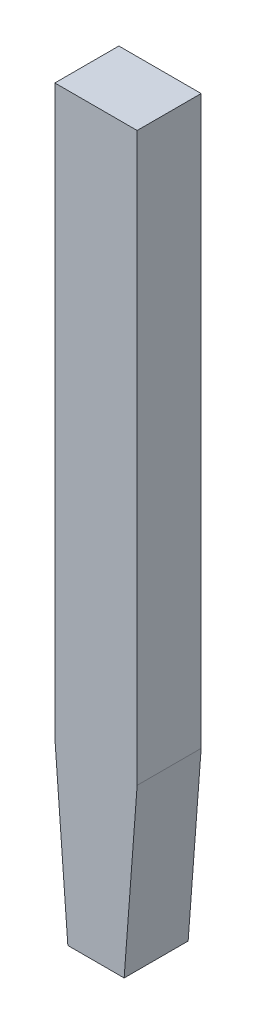
ISO-10303-21;
HEADER;
FILE_DESCRIPTION(('STEP AP214'),'2;1');
FILE_NAME('part.step','',(''),(''),'','','');
FILE_SCHEMA(('AUTOMOTIVE_DESIGN { 1 0 10303 214 1 1 1 1 }'));
ENDSEC;
DATA;
#1=APPLICATION_CONTEXT('core data for automotive mechanical design processes');
#2=APPLICATION_PROTOCOL_DEFINITION('international standard','automotive_design',2000,#1);
#3=PRODUCT_CONTEXT('',#1,'mechanical');
#4=PRODUCT('Part','Part','',(#3));
#5=PRODUCT_RELATED_PRODUCT_CATEGORY('part','',(#4));
#6=PRODUCT_DEFINITION_FORMATION('','',#4);
#7=PRODUCT_DEFINITION_CONTEXT('part definition',#1,'design');
#8=PRODUCT_DEFINITION('design','',#6,#7);
#9=PRODUCT_DEFINITION_SHAPE('','',#8);
#10=(LENGTH_UNIT() NAMED_UNIT(*) SI_UNIT(.MILLI.,.METRE.));
#11=(NAMED_UNIT(*) PLANE_ANGLE_UNIT() SI_UNIT($,.RADIAN.));
#12=(NAMED_UNIT(*) SI_UNIT($,.STERADIAN.) SOLID_ANGLE_UNIT());
#13=UNCERTAINTY_MEASURE_WITH_UNIT(LENGTH_MEASURE(1.E-05),#10,'distance_accuracy_value','');
#14=(GEOMETRIC_REPRESENTATION_CONTEXT(3) GLOBAL_UNCERTAINTY_ASSIGNED_CONTEXT((#13)) GLOBAL_UNIT_ASSIGNED_CONTEXT((#10,
#11,#12)) REPRESENTATION_CONTEXT('',''));
#15=CARTESIAN_POINT('',(0.,0.,0.));
#16=DIRECTION('',(0.,0.,1.));
#17=DIRECTION('',(1.,0.,0.));
#18=AXIS2_PLACEMENT_3D('',#15,#16,#17);
#19=CARTESIAN_POINT('',(50.41457889831,1.696835055312,3.705000000046));
#20=DIRECTION('',(0.,0.,1.));
#21=DIRECTION('',(1.,0.,0.));
#22=AXIS2_PLACEMENT_3D('',#19,#20,#21);
#23=PLANE('',#22);
#24=DIRECTION('',(1.,0.,0.));
#25=VECTOR('',#24,1.);
#26=CARTESIAN_POINT('',(38.93957889831,-15.17126218978,3.705000000046));
#27=LINE('',#26,#25);
#28=CARTESIAN_POINT('',(51.9806861916904,-15.17126218978,3.705000000046));
#29=VERTEX_POINT('',#28);
#30=CARTESIAN_POINT('',(52.2884716049296,-15.17126218978,3.705000000046));
#31=VERTEX_POINT('',#30);
#32=EDGE_CURVE('E94',#29,#31,#27,.T.);
#33=ORIENTED_EDGE('',*,*,#32,.T.);
#34=DIRECTION('',(0.0747899482416168,0.997199309888458,0.));
#35=VECTOR('',#34,1.);
#36=CARTESIAN_POINT('',(52.35957889831,-14.22316494469,3.705000000046));
#37=LINE('',#36,#35);
#38=CARTESIAN_POINT('',(52.35957889831,-14.2231649446899,3.705000000046));
#39=VERTEX_POINT('',#38);
#40=EDGE_CURVE('E98',#39,#31,#37,.F.);
#41=ORIENTED_EDGE('',*,*,#40,.F.);
#42=DIRECTION('',(0.,1.,0.));
#43=VECTOR('',#42,1.);
#44=CARTESIAN_POINT('',(52.35957889831,-10.46816494469,3.705000000046));
#45=LINE('',#44,#43);
#46=CARTESIAN_POINT('',(52.35957889831,-11.12202888849,3.705000000046));
#47=VERTEX_POINT('',#46);
#48=EDGE_CURVE('E83',#47,#39,#45,.F.);
#49=ORIENTED_EDGE('',*,*,#48,.F.);
#50=DIRECTION('',(1.,0.,0.));
#51=VECTOR('',#50,1.);
#52=CARTESIAN_POINT('',(44.47457889831,-11.12202888849,3.705000000046));
#53=LINE('',#52,#51);
#54=CARTESIAN_POINT('',(51.90957889831,-11.12202888849,3.705000000046));
#55=VERTEX_POINT('',#54);
#56=EDGE_CURVE('E20',#47,#55,#53,.F.);
#57=ORIENTED_EDGE('',*,*,#56,.T.);
#58=DIRECTION('',(0.,1.,0.));
#59=VECTOR('',#58,1.);
#60=CARTESIAN_POINT('',(51.90957889831,-10.46816494469,3.705000000046));
#61=LINE('',#60,#59);
#62=CARTESIAN_POINT('',(51.90957889831,-14.2231649446902,3.705000000046));
#63=VERTEX_POINT('',#62);
#64=EDGE_CURVE('E71',#63,#55,#61,.T.);
#65=ORIENTED_EDGE('',*,*,#64,.F.);
#66=DIRECTION('',(0.0747899482416168,-0.997199309888458,0.));
#67=VECTOR('',#66,1.);
#68=CARTESIAN_POINT('',(51.90957889831,-14.22316494469,3.705000000046));
#69=LINE('',#68,#67);
#70=EDGE_CURVE('E66',#29,#63,#69,.F.);
#71=ORIENTED_EDGE('',*,*,#70,.F.);
#72=EDGE_LOOP('',(#33,#41,#49,#57,#65,#71));
#73=FACE_BOUND('',#72,.T.);
#74=ADVANCED_FACE('F17',(#73),#23,.T.);
#75=CARTESIAN_POINT('',(44.47457889831,-11.12202888849,-0.158278306686));
#76=DIRECTION('',(0.,-1.,0.));
#77=DIRECTION('',(0.,0.,-1.));
#78=AXIS2_PLACEMENT_3D('',#75,#76,#77);
#79=PLANE('',#78);
#80=DIRECTION('',(1.,0.,0.));
#81=VECTOR('',#80,1.);
#82=CARTESIAN_POINT('',(50.41457889831,-11.12202888849,3.355000000046));
#83=LINE('',#82,#81);
#84=CARTESIAN_POINT('',(52.35957889831,-11.12202888849,3.355000000046));
#85=VERTEX_POINT('',#84);
#86=CARTESIAN_POINT('',(51.90957889831,-11.12202888849,3.355000000046));
#87=VERTEX_POINT('',#86);
#88=EDGE_CURVE('E89',#85,#87,#83,.F.);
#89=ORIENTED_EDGE('',*,*,#88,.T.);
#90=DIRECTION('',(0.,0.,1.));
#91=VECTOR('',#90,1.);
#92=CARTESIAN_POINT('',(51.90957889831,-11.12202888849,3.355000000046));
#93=LINE('',#92,#91);
#94=EDGE_CURVE('E76',#55,#87,#93,.F.);
#95=ORIENTED_EDGE('',*,*,#94,.F.);
#96=ORIENTED_EDGE('',*,*,#56,.F.);
#97=DIRECTION('',(0.,0.,-1.));
#98=VECTOR('',#97,1.);
#99=CARTESIAN_POINT('',(52.35957889831,-11.12202888849,3.355000000046));
#100=LINE('',#99,#98);
#101=EDGE_CURVE('E102',#85,#47,#100,.F.);
#102=ORIENTED_EDGE('',*,*,#101,.F.);
#103=EDGE_LOOP('',(#89,#95,#96,#102));
#104=FACE_BOUND('',#103,.T.);
#105=ADVANCED_FACE('F88',(#104),#79,.F.);
#106=CARTESIAN_POINT('',(51.90957889831,-10.46816494469,3.355000000046));
#107=DIRECTION('',(-1.,0.,0.));
#108=DIRECTION('',(0.,0.,1.));
#109=AXIS2_PLACEMENT_3D('',#106,#107,#108);
#110=PLANE('',#109);
#111=DIRECTION('',(0.,1.,0.));
#112=VECTOR('',#111,1.);
#113=CARTESIAN_POINT('',(51.90957889831,1.696835055312,3.355000000046));
#114=LINE('',#113,#112);
#115=CARTESIAN_POINT('',(51.90957889831,-14.2231649446901,3.355000000046));
#116=VERTEX_POINT('',#115);
#117=EDGE_CURVE('E107',#87,#116,#114,.F.);
#118=ORIENTED_EDGE('',*,*,#117,.T.);
#119=DIRECTION('',(0.,0.,1.));
#120=VECTOR('',#119,1.);
#121=CARTESIAN_POINT('',(51.90957889831,-14.22316494469,3.355000000046));
#122=LINE('',#121,#120);
#123=EDGE_CURVE('E78',#63,#116,#122,.F.);
#124=ORIENTED_EDGE('',*,*,#123,.F.);
#125=ORIENTED_EDGE('',*,*,#64,.T.);
#126=ORIENTED_EDGE('',*,*,#94,.T.);
#127=EDGE_LOOP('',(#118,#124,#125,#126));
#128=FACE_BOUND('',#127,.T.);
#129=ADVANCED_FACE('F74',(#128),#110,.T.);
#130=CARTESIAN_POINT('',(51.90957889831,-14.22316494469,3.355000000046));
#131=DIRECTION('',(-0.997199309888458,-0.0747899482416168,0.));
#132=DIRECTION('',(0.0747899482416168,-0.997199309888458,0.));
#133=AXIS2_PLACEMENT_3D('',#130,#131,#132);
#134=PLANE('',#133);
#135=ORIENTED_EDGE('',*,*,#70,.T.);
#136=ORIENTED_EDGE('',*,*,#123,.T.);
#137=DIRECTION('',(0.0747899482397982,-0.997199309888594,0.));
#138=VECTOR('',#137,1.);
#139=CARTESIAN_POINT('',(51.90957889831,-14.22316494469,3.355000000046));
#140=LINE('',#139,#138);
#141=CARTESIAN_POINT('',(51.9806861916909,-15.1712621897799,3.355000000046));
#142=VERTEX_POINT('',#141);
#143=EDGE_CURVE('E109',#116,#142,#140,.T.);
#144=ORIENTED_EDGE('',*,*,#143,.T.);
#145=DIRECTION('',(0.,0.,1.));
#146=VECTOR('',#145,1.);
#147=CARTESIAN_POINT('',(51.98068619169,-15.17126218978,-0.8137967800219));
#148=LINE('',#147,#146);
#149=EDGE_CURVE('E96',#142,#29,#148,.T.);
#150=ORIENTED_EDGE('',*,*,#149,.T.);
#151=EDGE_LOOP('',(#135,#136,#144,#150));
#152=FACE_BOUND('',#151,.T.);
#153=ADVANCED_FACE('F126',(#152),#134,.T.);
#154=CARTESIAN_POINT('',(38.93957889831,-15.17126218978,-0.8137967800219));
#155=DIRECTION('',(0.,1.,0.));
#156=DIRECTION('',(0.,0.,1.));
#157=AXIS2_PLACEMENT_3D('',#154,#155,#156);
#158=PLANE('',#157);
#159=DIRECTION('',(1.,0.,0.));
#160=VECTOR('',#159,1.);
#161=CARTESIAN_POINT('',(50.41457889831,-15.17126218978,3.355000000046));
#162=LINE('',#161,#160);
#163=CARTESIAN_POINT('',(52.2884716049296,-15.17126218978,3.355000000046));
#164=VERTEX_POINT('',#163);
#165=EDGE_CURVE('E112',#142,#164,#162,.T.);
#166=ORIENTED_EDGE('',*,*,#165,.T.);
#167=DIRECTION('',(0.,0.,1.));
#168=VECTOR('',#167,1.);
#169=CARTESIAN_POINT('',(52.2884716049283,-15.1712621897799,3.355000000046));
#170=LINE('',#169,#168);
#171=EDGE_CURVE('E100',#31,#164,#170,.F.);
#172=ORIENTED_EDGE('',*,*,#171,.F.);
#173=ORIENTED_EDGE('',*,*,#32,.F.);
#174=ORIENTED_EDGE('',*,*,#149,.F.);
#175=EDGE_LOOP('',(#166,#172,#173,#174));
#176=FACE_BOUND('',#175,.T.);
#177=ADVANCED_FACE('F125',(#176),#158,.F.);
#178=CARTESIAN_POINT('',(52.35957889831,-14.22316494469,3.355000000046));
#179=DIRECTION('',(0.997199309888458,-0.0747899482416168,0.));
#180=DIRECTION('',(0.0747899482416168,0.997199309888458,0.));
#181=AXIS2_PLACEMENT_3D('',#178,#179,#180);
#182=PLANE('',#181);
#183=DIRECTION('',(0.0747899482397982,0.997199309888594,0.));
#184=VECTOR('',#183,1.);
#185=CARTESIAN_POINT('',(52.28847160493,-15.17126218978,3.355000000046));
#186=LINE('',#185,#184);
#187=CARTESIAN_POINT('',(52.35957889831,-14.22316494469,3.355000000046));
#188=VERTEX_POINT('',#187);
#189=EDGE_CURVE('E26',#164,#188,#186,.T.);
#190=ORIENTED_EDGE('',*,*,#189,.T.);
#191=DIRECTION('',(0.,0.,-1.));
#192=VECTOR('',#191,1.);
#193=CARTESIAN_POINT('',(52.35957889831,-14.22316494469,3.355000000046));
#194=LINE('',#193,#192);
#195=EDGE_CURVE('E34',#39,#188,#194,.T.);
#196=ORIENTED_EDGE('',*,*,#195,.F.);
#197=ORIENTED_EDGE('',*,*,#40,.T.);
#198=ORIENTED_EDGE('',*,*,#171,.T.);
#199=EDGE_LOOP('',(#190,#196,#197,#198));
#200=FACE_BOUND('',#199,.T.);
#201=ADVANCED_FACE('F118',(#200),#182,.T.);
#202=CARTESIAN_POINT('',(52.35957889831,-10.46816494469,3.355000000046));
#203=DIRECTION('',(1.,0.,0.));
#204=DIRECTION('',(0.,0.,-1.));
#205=AXIS2_PLACEMENT_3D('',#202,#203,#204);
#206=PLANE('',#205);
#207=ORIENTED_EDGE('',*,*,#48,.T.);
#208=ORIENTED_EDGE('',*,*,#195,.T.);
#209=DIRECTION('',(0.,1.,0.));
#210=VECTOR('',#209,1.);
#211=CARTESIAN_POINT('',(52.35957889831,1.696835055312,3.355000000046));
#212=LINE('',#211,#210);
#213=EDGE_CURVE('E11',#188,#85,#212,.T.);
#214=ORIENTED_EDGE('',*,*,#213,.T.);
#215=ORIENTED_EDGE('',*,*,#101,.T.);
#216=EDGE_LOOP('',(#207,#208,#214,#215));
#217=FACE_BOUND('',#216,.T.);
#218=ADVANCED_FACE('F127',(#217),#206,.T.);
#219=CARTESIAN_POINT('',(50.41457889831,1.696835055312,3.355000000046));
#220=DIRECTION('',(0.,0.,1.));
#221=DIRECTION('',(1.,0.,0.));
#222=AXIS2_PLACEMENT_3D('',#219,#220,#221);
#223=PLANE('',#222);
#224=ORIENTED_EDGE('',*,*,#189,.F.);
#225=ORIENTED_EDGE('',*,*,#165,.F.);
#226=ORIENTED_EDGE('',*,*,#143,.F.);
#227=ORIENTED_EDGE('',*,*,#117,.F.);
#228=ORIENTED_EDGE('',*,*,#88,.F.);
#229=ORIENTED_EDGE('',*,*,#213,.F.);
#230=EDGE_LOOP('',(#224,#225,#226,#227,#228,#229));
#231=FACE_BOUND('',#230,.T.);
#232=ADVANCED_FACE('F122',(#231),#223,.F.);
#233=CLOSED_SHELL('',(#74,#105,#129,#153,#177,#201,#218,#232));
#234=MANIFOLD_SOLID_BREP('B1',#233);
#235=ADVANCED_BREP_SHAPE_REPRESENTATION('',(#18,#234),#14);
#236=SHAPE_DEFINITION_REPRESENTATION(#9,#235);
ENDSEC;
END-ISO-10303-21;
